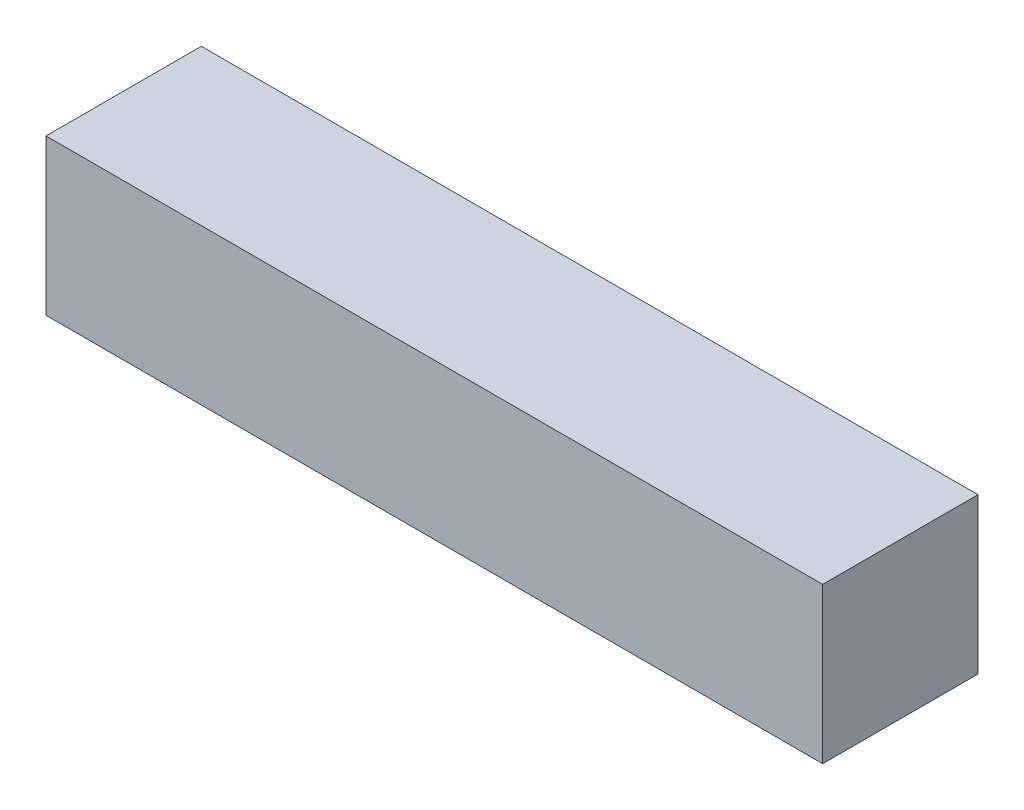
ISO-10303-21;
HEADER;
FILE_DESCRIPTION(('STEP AP214'),'2;1');
FILE_NAME('part.step','',(''),(''),'','','');
FILE_SCHEMA(('AUTOMOTIVE_DESIGN { 1 0 10303 214 1 1 1 1 }'));
ENDSEC;
DATA;
#1=APPLICATION_CONTEXT('core data for automotive mechanical design processes');
#2=APPLICATION_PROTOCOL_DEFINITION('international standard','automotive_design',2000,#1);
#3=PRODUCT_CONTEXT('',#1,'mechanical');
#4=PRODUCT('Part','Part','',(#3));
#5=PRODUCT_RELATED_PRODUCT_CATEGORY('part','',(#4));
#6=PRODUCT_DEFINITION_FORMATION('','',#4);
#7=PRODUCT_DEFINITION_CONTEXT('part definition',#1,'design');
#8=PRODUCT_DEFINITION('design','',#6,#7);
#9=PRODUCT_DEFINITION_SHAPE('','',#8);
#10=(LENGTH_UNIT() NAMED_UNIT(*) SI_UNIT(.MILLI.,.METRE.));
#11=(NAMED_UNIT(*) PLANE_ANGLE_UNIT() SI_UNIT($,.RADIAN.));
#12=(NAMED_UNIT(*) SI_UNIT($,.STERADIAN.) SOLID_ANGLE_UNIT());
#13=UNCERTAINTY_MEASURE_WITH_UNIT(LENGTH_MEASURE(1.E-05),#10,'distance_accuracy_value','');
#14=(GEOMETRIC_REPRESENTATION_CONTEXT(3) GLOBAL_UNCERTAINTY_ASSIGNED_CONTEXT((#13)) GLOBAL_UNIT_ASSIGNED_CONTEXT((#10,
#11,#12)) REPRESENTATION_CONTEXT('',''));
#15=CARTESIAN_POINT('',(0.,0.,0.));
#16=DIRECTION('',(0.,0.,1.));
#17=DIRECTION('',(1.,0.,0.));
#18=AXIS2_PLACEMENT_3D('',#15,#16,#17);
#19=CARTESIAN_POINT('',(127.,0.,25.4));
#20=DIRECTION('',(0.,1.,0.));
#21=DIRECTION('',(0.,0.,1.));
#22=AXIS2_PLACEMENT_3D('',#19,#20,#21);
#23=PLANE('',#22);
#24=DIRECTION('',(1.,0.,0.));
#25=VECTOR('',#24,1.);
#26=CARTESIAN_POINT('',(127.,0.,0.));
#27=LINE('',#26,#25);
#28=CARTESIAN_POINT('',(0.,0.,0.));
#29=VERTEX_POINT('',#28);
#30=CARTESIAN_POINT('',(127.,0.,0.));
#31=VERTEX_POINT('',#30);
#32=EDGE_CURVE('E96',#29,#31,#27,.T.);
#33=ORIENTED_EDGE('',*,*,#32,.T.);
#34=DIRECTION('',(0.,0.,-1.));
#35=VECTOR('',#34,1.);
#36=CARTESIAN_POINT('',(127.,0.,25.4));
#37=LINE('',#36,#35);
#38=CARTESIAN_POINT('',(127.,0.,25.4));
#39=VERTEX_POINT('',#38);
#40=EDGE_CURVE('E11',#39,#31,#37,.T.);
#41=ORIENTED_EDGE('',*,*,#40,.F.);
#42=DIRECTION('',(1.,0.,0.));
#43=VECTOR('',#42,1.);
#44=CARTESIAN_POINT('',(127.,0.,25.4));
#45=LINE('',#44,#43);
#46=CARTESIAN_POINT('',(0.,0.,25.4));
#47=VERTEX_POINT('',#46);
#48=EDGE_CURVE('E84',#47,#39,#45,.T.);
#49=ORIENTED_EDGE('',*,*,#48,.F.);
#50=DIRECTION('',(0.,0.,-1.));
#51=VECTOR('',#50,1.);
#52=CARTESIAN_POINT('',(0.,0.,25.4));
#53=LINE('',#52,#51);
#54=EDGE_CURVE('E92',#47,#29,#53,.T.);
#55=ORIENTED_EDGE('',*,*,#54,.T.);
#56=EDGE_LOOP('',(#33,#41,#49,#55));
#57=FACE_BOUND('',#56,.T.);
#58=ADVANCED_FACE('F33',(#57),#23,.F.);
#59=CARTESIAN_POINT('',(127.,25.4,25.4));
#60=DIRECTION('',(-1.,0.,0.));
#61=DIRECTION('',(0.,0.,1.));
#62=AXIS2_PLACEMENT_3D('',#59,#60,#61);
#63=PLANE('',#62);
#64=DIRECTION('',(0.,1.,0.));
#65=VECTOR('',#64,1.);
#66=CARTESIAN_POINT('',(127.,25.4,0.));
#67=LINE('',#66,#65);
#68=CARTESIAN_POINT('',(127.,25.4,0.));
#69=VERTEX_POINT('',#68);
#70=EDGE_CURVE('E88',#31,#69,#67,.T.);
#71=ORIENTED_EDGE('',*,*,#70,.T.);
#72=DIRECTION('',(0.,0.,-1.));
#73=VECTOR('',#72,1.);
#74=CARTESIAN_POINT('',(127.,25.4,25.4));
#75=LINE('',#74,#73);
#76=CARTESIAN_POINT('',(127.,25.4,25.4));
#77=VERTEX_POINT('',#76);
#78=EDGE_CURVE('E41',#77,#69,#75,.T.);
#79=ORIENTED_EDGE('',*,*,#78,.F.);
#80=DIRECTION('',(0.,1.,0.));
#81=VECTOR('',#80,1.);
#82=CARTESIAN_POINT('',(127.,25.4,25.4));
#83=LINE('',#82,#81);
#84=EDGE_CURVE('E79',#39,#77,#83,.T.);
#85=ORIENTED_EDGE('',*,*,#84,.F.);
#86=ORIENTED_EDGE('',*,*,#40,.T.);
#87=EDGE_LOOP('',(#71,#79,#85,#86));
#88=FACE_BOUND('',#87,.T.);
#89=ADVANCED_FACE('F87',(#88),#63,.F.);
#90=CARTESIAN_POINT('',(0.,25.4,25.4));
#91=DIRECTION('',(0.,-1.,0.));
#92=DIRECTION('',(0.,0.,-1.));
#93=AXIS2_PLACEMENT_3D('',#90,#91,#92);
#94=PLANE('',#93);
#95=DIRECTION('',(-1.,0.,0.));
#96=VECTOR('',#95,1.);
#97=CARTESIAN_POINT('',(0.,25.4,0.));
#98=LINE('',#97,#96);
#99=CARTESIAN_POINT('',(0.,25.4,0.));
#100=VERTEX_POINT('',#99);
#101=EDGE_CURVE('E66',#69,#100,#98,.T.);
#102=ORIENTED_EDGE('',*,*,#101,.T.);
#103=DIRECTION('',(0.,0.,-1.));
#104=VECTOR('',#103,1.);
#105=CARTESIAN_POINT('',(0.,25.4,25.4));
#106=LINE('',#105,#104);
#107=CARTESIAN_POINT('',(0.,25.4,25.4));
#108=VERTEX_POINT('',#107);
#109=EDGE_CURVE('E89',#108,#100,#106,.T.);
#110=ORIENTED_EDGE('',*,*,#109,.F.);
#111=DIRECTION('',(-1.,0.,0.));
#112=VECTOR('',#111,1.);
#113=CARTESIAN_POINT('',(0.,25.4,25.4));
#114=LINE('',#113,#112);
#115=EDGE_CURVE('E82',#77,#108,#114,.T.);
#116=ORIENTED_EDGE('',*,*,#115,.F.);
#117=ORIENTED_EDGE('',*,*,#78,.T.);
#118=EDGE_LOOP('',(#102,#110,#116,#117));
#119=FACE_BOUND('',#118,.T.);
#120=ADVANCED_FACE('F90',(#119),#94,.F.);
#121=CARTESIAN_POINT('',(0.,0.,25.4));
#122=DIRECTION('',(1.,0.,0.));
#123=DIRECTION('',(0.,0.,-1.));
#124=AXIS2_PLACEMENT_3D('',#121,#122,#123);
#125=PLANE('',#124);
#126=DIRECTION('',(0.,-1.,0.));
#127=VECTOR('',#126,1.);
#128=CARTESIAN_POINT('',(0.,0.,0.));
#129=LINE('',#128,#127);
#130=EDGE_CURVE('E72',#100,#29,#129,.T.);
#131=ORIENTED_EDGE('',*,*,#130,.T.);
#132=ORIENTED_EDGE('',*,*,#54,.F.);
#133=DIRECTION('',(0.,-1.,0.));
#134=VECTOR('',#133,1.);
#135=CARTESIAN_POINT('',(0.,0.,25.4));
#136=LINE('',#135,#134);
#137=EDGE_CURVE('E49',#108,#47,#136,.T.);
#138=ORIENTED_EDGE('',*,*,#137,.F.);
#139=ORIENTED_EDGE('',*,*,#109,.T.);
#140=EDGE_LOOP('',(#131,#132,#138,#139));
#141=FACE_BOUND('',#140,.T.);
#142=ADVANCED_FACE('F103',(#141),#125,.F.);
#143=CARTESIAN_POINT('',(0.,0.,25.4));
#144=DIRECTION('',(0.,0.,-1.));
#145=DIRECTION('',(-1.,0.,0.));
#146=AXIS2_PLACEMENT_3D('',#143,#144,#145);
#147=PLANE('',#146);
#148=ORIENTED_EDGE('',*,*,#48,.T.);
#149=ORIENTED_EDGE('',*,*,#84,.T.);
#150=ORIENTED_EDGE('',*,*,#115,.T.);
#151=ORIENTED_EDGE('',*,*,#137,.T.);
#152=EDGE_LOOP('',(#148,#149,#150,#151));
#153=FACE_BOUND('',#152,.T.);
#154=ADVANCED_FACE('F80',(#153),#147,.F.);
#155=CARTESIAN_POINT('',(0.,0.,0.));
#156=DIRECTION('',(0.,0.,-1.));
#157=DIRECTION('',(-1.,0.,0.));
#158=AXIS2_PLACEMENT_3D('',#155,#156,#157);
#159=PLANE('',#158);
#160=ORIENTED_EDGE('',*,*,#32,.F.);
#161=ORIENTED_EDGE('',*,*,#130,.F.);
#162=ORIENTED_EDGE('',*,*,#101,.F.);
#163=ORIENTED_EDGE('',*,*,#70,.F.);
#164=EDGE_LOOP('',(#160,#161,#162,#163));
#165=FACE_BOUND('',#164,.T.);
#166=ADVANCED_FACE('F106',(#165),#159,.T.);
#167=CLOSED_SHELL('',(#58,#89,#120,#142,#154,#166));
#168=MANIFOLD_SOLID_BREP('B2',#167);
#169=ADVANCED_BREP_SHAPE_REPRESENTATION('',(#18,#168),#14);
#170=SHAPE_DEFINITION_REPRESENTATION(#9,#169);
ENDSEC;
END-ISO-10303-21;
